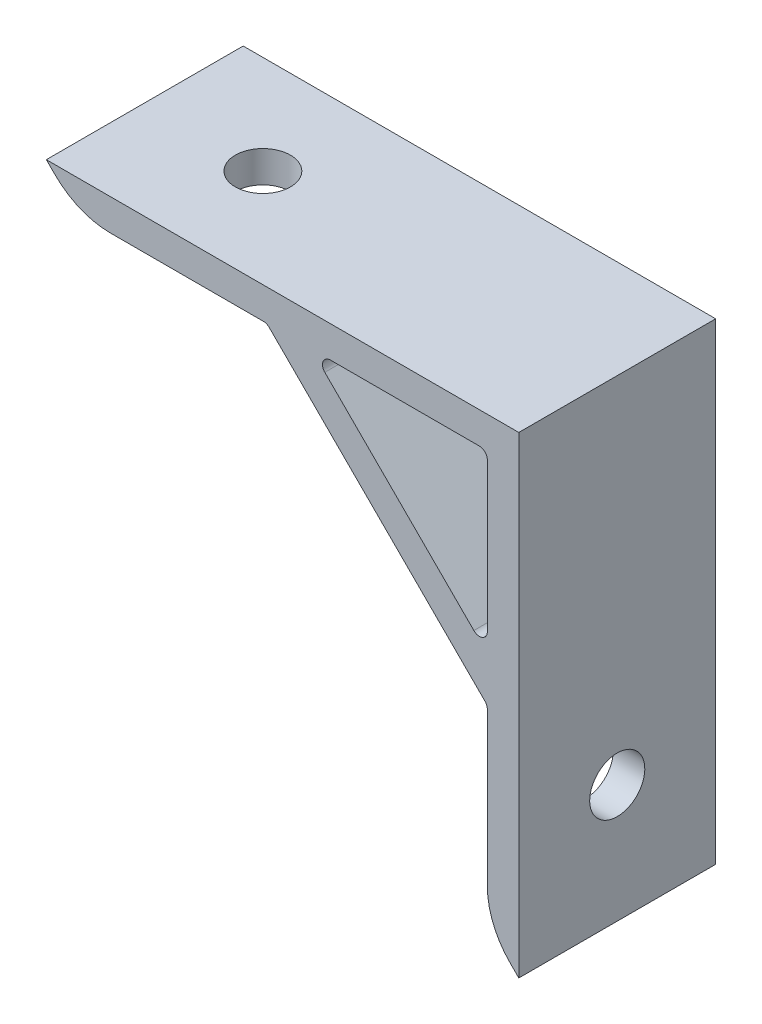
ISO-10303-21;
HEADER;
FILE_DESCRIPTION(('STEP AP214'),'2;1');
FILE_NAME('part.step','',(''),(''),'','','');
FILE_SCHEMA(('AUTOMOTIVE_DESIGN { 1 0 10303 214 1 1 1 1 }'));
ENDSEC;
DATA;
#1=APPLICATION_CONTEXT('core data for automotive mechanical design processes');
#2=APPLICATION_PROTOCOL_DEFINITION('international standard','automotive_design',2000,#1);
#3=PRODUCT_CONTEXT('',#1,'mechanical');
#4=PRODUCT('Part','Part','',(#3));
#5=PRODUCT_RELATED_PRODUCT_CATEGORY('part','',(#4));
#6=PRODUCT_DEFINITION_FORMATION('','',#4);
#7=PRODUCT_DEFINITION_CONTEXT('part definition',#1,'design');
#8=PRODUCT_DEFINITION('design','',#6,#7);
#9=PRODUCT_DEFINITION_SHAPE('','',#8);
#10=(LENGTH_UNIT() NAMED_UNIT(*) SI_UNIT(.MILLI.,.METRE.));
#11=(NAMED_UNIT(*) PLANE_ANGLE_UNIT() SI_UNIT($,.RADIAN.));
#12=(NAMED_UNIT(*) SI_UNIT($,.STERADIAN.) SOLID_ANGLE_UNIT());
#13=UNCERTAINTY_MEASURE_WITH_UNIT(LENGTH_MEASURE(1.E-05),#10,'distance_accuracy_value','');
#14=(GEOMETRIC_REPRESENTATION_CONTEXT(3) GLOBAL_UNCERTAINTY_ASSIGNED_CONTEXT((#13)) GLOBAL_UNIT_ASSIGNED_CONTEXT((#10,
#11,#12)) REPRESENTATION_CONTEXT('',''));
#15=CARTESIAN_POINT('',(0.,0.,0.));
#16=DIRECTION('',(0.,0.,1.));
#17=DIRECTION('',(1.,0.,0.));
#18=AXIS2_PLACEMENT_3D('',#15,#16,#17);
#19=CARTESIAN_POINT('',(0.,0.,25.));
#20=DIRECTION('',(0.,0.,1.));
#21=DIRECTION('',(1.,0.,0.));
#22=AXIS2_PLACEMENT_3D('',#19,#20,#21);
#23=PLANE('',#22);
#24=DIRECTION('',(0.707106781186548,-0.707106781186547,0.));
#25=VECTOR('',#24,1.);
#26=CARTESIAN_POINT('',(-2.,26.,25.));
#27=LINE('',#26,#25);
#28=CARTESIAN_POINT('',(-1.70710678118655,25.7071067811865,25.));
#29=VERTEX_POINT('',#28);
#30=CARTESIAN_POINT('',(25.7071067811866,-1.70710678118655,25.));
#31=VERTEX_POINT('',#30);
#32=EDGE_CURVE('E298',#29,#31,#27,.T.);
#33=ORIENTED_EDGE('',*,*,#32,.T.);
#34=CARTESIAN_POINT('',(25.,-2.41421356237309,25.));
#35=DIRECTION('',(0.,0.,1.));
#36=DIRECTION('',(1.,0.,0.));
#37=AXIS2_PLACEMENT_3D('',#34,#35,#36);
#38=CIRCLE('',#37,1.);
#39=CARTESIAN_POINT('',(26.,-2.41421356237309,25.));
#40=VERTEX_POINT('',#39);
#41=EDGE_CURVE('E256',#31,#40,#38,.F.);
#42=ORIENTED_EDGE('',*,*,#41,.T.);
#43=DIRECTION('',(0.,-1.,0.));
#44=VECTOR('',#43,1.);
#45=CARTESIAN_POINT('',(26.,-1.99999999999999,25.));
#46=LINE('',#45,#44);
#47=CARTESIAN_POINT('',(26.,-21.8578643762691,25.));
#48=VERTEX_POINT('',#47);
#49=EDGE_CURVE('E163',#40,#48,#46,.T.);
#50=ORIENTED_EDGE('',*,*,#49,.T.);
#51=CARTESIAN_POINT('',(36.,-21.8578643762691,25.));
#52=DIRECTION('',(0.,0.,1.));
#53=DIRECTION('',(1.,0.,0.));
#54=AXIS2_PLACEMENT_3D('',#51,#52,#53);
#55=CIRCLE('',#54,10.);
#56=CARTESIAN_POINT('',(28.9289321881345,-28.9289321881345,25.));
#57=VERTEX_POINT('',#56);
#58=EDGE_CURVE('E159',#48,#57,#55,.T.);
#59=ORIENTED_EDGE('',*,*,#58,.T.);
#60=DIRECTION('',(0.707106781186548,-0.707106781186547,0.));
#61=VECTOR('',#60,1.);
#62=CARTESIAN_POINT('',(30.,-30.,25.));
#63=LINE('',#62,#61);
#64=CARTESIAN_POINT('',(30.,-30.,25.));
#65=VERTEX_POINT('',#64);
#66=EDGE_CURVE('E152',#57,#65,#63,.T.);
#67=ORIENTED_EDGE('',*,*,#66,.T.);
#68=DIRECTION('',(0.,1.,0.));
#69=VECTOR('',#68,1.);
#70=CARTESIAN_POINT('',(30.,30.,25.));
#71=LINE('',#70,#69);
#72=CARTESIAN_POINT('',(30.,30.,25.));
#73=VERTEX_POINT('',#72);
#74=EDGE_CURVE('E156',#65,#73,#71,.T.);
#75=ORIENTED_EDGE('',*,*,#74,.T.);
#76=DIRECTION('',(-1.,0.,0.));
#77=VECTOR('',#76,1.);
#78=CARTESIAN_POINT('',(-30.,30.,25.));
#79=LINE('',#78,#77);
#80=CARTESIAN_POINT('',(-30.,30.,25.));
#81=VERTEX_POINT('',#80);
#82=EDGE_CURVE('E178',#73,#81,#79,.T.);
#83=ORIENTED_EDGE('',*,*,#82,.T.);
#84=DIRECTION('',(0.707106781186548,-0.707106781186548,0.));
#85=VECTOR('',#84,1.);
#86=CARTESIAN_POINT('',(-30.,30.,25.));
#87=LINE('',#86,#85);
#88=CARTESIAN_POINT('',(-28.9289321881345,28.9289321881345,25.));
#89=VERTEX_POINT('',#88);
#90=EDGE_CURVE('E201',#81,#89,#87,.T.);
#91=ORIENTED_EDGE('',*,*,#90,.T.);
#92=CARTESIAN_POINT('',(-21.8578643762691,36.,25.));
#93=DIRECTION('',(0.,0.,1.));
#94=DIRECTION('',(1.,0.,0.));
#95=AXIS2_PLACEMENT_3D('',#92,#93,#94);
#96=CIRCLE('',#95,10.);
#97=CARTESIAN_POINT('',(-21.8578643762691,26.,25.));
#98=VERTEX_POINT('',#97);
#99=EDGE_CURVE('E214',#89,#98,#96,.T.);
#100=ORIENTED_EDGE('',*,*,#99,.T.);
#101=DIRECTION('',(1.,0.,0.));
#102=VECTOR('',#101,1.);
#103=CARTESIAN_POINT('',(-26.,26.,25.));
#104=LINE('',#103,#102);
#105=CARTESIAN_POINT('',(-2.4142135623731,26.,25.));
#106=VERTEX_POINT('',#105);
#107=EDGE_CURVE('E295',#98,#106,#104,.T.);
#108=ORIENTED_EDGE('',*,*,#107,.T.);
#109=CARTESIAN_POINT('',(-2.4142135623731,25.,25.));
#110=DIRECTION('',(0.,0.,1.));
#111=DIRECTION('',(1.,0.,0.));
#112=AXIS2_PLACEMENT_3D('',#109,#110,#111);
#113=CIRCLE('',#112,1.);
#114=EDGE_CURVE('E252',#106,#29,#113,.F.);
#115=ORIENTED_EDGE('',*,*,#114,.T.);
#116=EDGE_LOOP('',(#33,#42,#50,#59,#67,#75,#83,#91,#100,#108,#115));
#117=FACE_BOUND('',#116,.T.);
#118=DIRECTION('',(0.707106781186548,-0.707106781186547,0.));
#119=VECTOR('',#118,1.);
#120=CARTESIAN_POINT('',(3.65685424949237,26.,25.));
#121=LINE('',#120,#119);
#122=CARTESIAN_POINT('',(5.36396103067892,24.2928932188135,25.));
#123=VERTEX_POINT('',#122);
#124=CARTESIAN_POINT('',(24.2928932188135,5.36396103067892,25.));
#125=VERTEX_POINT('',#124);
#126=EDGE_CURVE('E279',#123,#125,#121,.T.);
#127=ORIENTED_EDGE('',*,*,#126,.F.);
#128=CARTESIAN_POINT('',(6.07106781186546,25.,25.));
#129=DIRECTION('',(0.,0.,1.));
#130=DIRECTION('',(1.,0.,0.));
#131=AXIS2_PLACEMENT_3D('',#128,#129,#130);
#132=CIRCLE('',#131,1.);
#133=CARTESIAN_POINT('',(6.07106781186546,26.,25.));
#134=VERTEX_POINT('',#133);
#135=EDGE_CURVE('E11',#123,#134,#132,.F.);
#136=ORIENTED_EDGE('',*,*,#135,.T.);
#137=DIRECTION('',(-1.,0.,0.));
#138=VECTOR('',#137,1.);
#139=CARTESIAN_POINT('',(3.65685424949237,26.,25.));
#140=LINE('',#139,#138);
#141=CARTESIAN_POINT('',(25.,26.,25.));
#142=VERTEX_POINT('',#141);
#143=EDGE_CURVE('E277',#142,#134,#140,.T.);
#144=ORIENTED_EDGE('',*,*,#143,.F.);
#145=CARTESIAN_POINT('',(25.,25.,25.));
#146=DIRECTION('',(0.,0.,1.));
#147=DIRECTION('',(1.,0.,0.));
#148=AXIS2_PLACEMENT_3D('',#145,#146,#147);
#149=CIRCLE('',#148,1.);
#150=CARTESIAN_POINT('',(26.,25.,25.));
#151=VERTEX_POINT('',#150);
#152=EDGE_CURVE('E248',#142,#151,#149,.F.);
#153=ORIENTED_EDGE('',*,*,#152,.T.);
#154=DIRECTION('',(0.,1.,0.));
#155=VECTOR('',#154,1.);
#156=CARTESIAN_POINT('',(26.,26.,25.));
#157=LINE('',#156,#155);
#158=CARTESIAN_POINT('',(26.,6.07106781186547,25.));
#159=VERTEX_POINT('',#158);
#160=EDGE_CURVE('E188',#159,#151,#157,.T.);
#161=ORIENTED_EDGE('',*,*,#160,.F.);
#162=CARTESIAN_POINT('',(25.,6.07106781186547,25.));
#163=DIRECTION('',(0.,0.,1.));
#164=DIRECTION('',(1.,0.,0.));
#165=AXIS2_PLACEMENT_3D('',#162,#163,#164);
#166=CIRCLE('',#165,1.);
#167=EDGE_CURVE('E48',#159,#125,#166,.F.);
#168=ORIENTED_EDGE('',*,*,#167,.T.);
#169=EDGE_LOOP('',(#127,#136,#144,#153,#161,#168));
#170=FACE_BOUND('',#169,.T.);
#171=ADVANCED_FACE('F33',(#117,#170),#23,.T.);
#172=CARTESIAN_POINT('',(0.,0.,0.));
#173=DIRECTION('',(0.,0.,1.));
#174=DIRECTION('',(1.,0.,0.));
#175=AXIS2_PLACEMENT_3D('',#172,#173,#174);
#176=PLANE('',#175);
#177=DIRECTION('',(0.707106781186548,-0.707106781186547,0.));
#178=VECTOR('',#177,1.);
#179=CARTESIAN_POINT('',(30.,-30.,0.));
#180=LINE('',#179,#178);
#181=CARTESIAN_POINT('',(28.9289321881345,-28.9289321881345,0.));
#182=VERTEX_POINT('',#181);
#183=CARTESIAN_POINT('',(30.,-30.,0.));
#184=VERTEX_POINT('',#183);
#185=EDGE_CURVE('E169',#182,#184,#180,.T.);
#186=ORIENTED_EDGE('',*,*,#185,.F.);
#187=CARTESIAN_POINT('',(36.,-21.8578643762691,0.));
#188=DIRECTION('',(0.,0.,1.));
#189=DIRECTION('',(1.,0.,0.));
#190=AXIS2_PLACEMENT_3D('',#187,#188,#189);
#191=CIRCLE('',#190,10.);
#192=CARTESIAN_POINT('',(26.,-21.8578643762691,0.));
#193=VERTEX_POINT('',#192);
#194=EDGE_CURVE('E208',#182,#193,#191,.F.);
#195=ORIENTED_EDGE('',*,*,#194,.T.);
#196=DIRECTION('',(0.,-1.,0.));
#197=VECTOR('',#196,1.);
#198=CARTESIAN_POINT('',(26.,-1.99999999999999,0.));
#199=LINE('',#198,#197);
#200=CARTESIAN_POINT('',(26.,-2.41421356237309,0.));
#201=VERTEX_POINT('',#200);
#202=EDGE_CURVE('E194',#201,#193,#199,.T.);
#203=ORIENTED_EDGE('',*,*,#202,.F.);
#204=CARTESIAN_POINT('',(25.,-2.41421356237309,0.));
#205=DIRECTION('',(0.,0.,1.));
#206=DIRECTION('',(1.,0.,0.));
#207=AXIS2_PLACEMENT_3D('',#204,#205,#206);
#208=CIRCLE('',#207,1.);
#209=CARTESIAN_POINT('',(25.7071067811866,-1.70710678118655,0.));
#210=VERTEX_POINT('',#209);
#211=EDGE_CURVE('E254',#201,#210,#208,.T.);
#212=ORIENTED_EDGE('',*,*,#211,.T.);
#213=DIRECTION('',(0.707106781186548,-0.707106781186547,0.));
#214=VECTOR('',#213,1.);
#215=CARTESIAN_POINT('',(-2.,26.,0.));
#216=LINE('',#215,#214);
#217=CARTESIAN_POINT('',(-1.70710678118655,25.7071067811865,0.));
#218=VERTEX_POINT('',#217);
#219=EDGE_CURVE('E191',#218,#210,#216,.T.);
#220=ORIENTED_EDGE('',*,*,#219,.F.);
#221=CARTESIAN_POINT('',(-2.4142135623731,25.,0.));
#222=DIRECTION('',(0.,0.,1.));
#223=DIRECTION('',(1.,0.,0.));
#224=AXIS2_PLACEMENT_3D('',#221,#222,#223);
#225=CIRCLE('',#224,1.);
#226=CARTESIAN_POINT('',(-2.4142135623731,26.,0.));
#227=VERTEX_POINT('',#226);
#228=EDGE_CURVE('E250',#218,#227,#225,.T.);
#229=ORIENTED_EDGE('',*,*,#228,.T.);
#230=DIRECTION('',(1.,0.,0.));
#231=VECTOR('',#230,1.);
#232=CARTESIAN_POINT('',(-26.,26.,0.));
#233=LINE('',#232,#231);
#234=CARTESIAN_POINT('',(-21.8578643762691,26.,0.));
#235=VERTEX_POINT('',#234);
#236=EDGE_CURVE('E187',#235,#227,#233,.T.);
#237=ORIENTED_EDGE('',*,*,#236,.F.);
#238=CARTESIAN_POINT('',(-21.8578643762691,36.,0.));
#239=DIRECTION('',(0.,0.,1.));
#240=DIRECTION('',(1.,0.,0.));
#241=AXIS2_PLACEMENT_3D('',#238,#239,#240);
#242=CIRCLE('',#241,10.);
#243=CARTESIAN_POINT('',(-28.9289321881345,28.9289321881345,0.));
#244=VERTEX_POINT('',#243);
#245=EDGE_CURVE('E206',#235,#244,#242,.F.);
#246=ORIENTED_EDGE('',*,*,#245,.T.);
#247=DIRECTION('',(0.707106781186548,-0.707106781186548,0.));
#248=VECTOR('',#247,1.);
#249=CARTESIAN_POINT('',(-30.,30.,0.));
#250=LINE('',#249,#248);
#251=CARTESIAN_POINT('',(-30.,30.,0.));
#252=VERTEX_POINT('',#251);
#253=EDGE_CURVE('E184',#252,#244,#250,.T.);
#254=ORIENTED_EDGE('',*,*,#253,.F.);
#255=DIRECTION('',(-1.,0.,0.));
#256=VECTOR('',#255,1.);
#257=CARTESIAN_POINT('',(-30.,30.,0.));
#258=LINE('',#257,#256);
#259=CARTESIAN_POINT('',(30.,30.,0.));
#260=VERTEX_POINT('',#259);
#261=EDGE_CURVE('E199',#260,#252,#258,.T.);
#262=ORIENTED_EDGE('',*,*,#261,.F.);
#263=DIRECTION('',(0.,1.,0.));
#264=VECTOR('',#263,1.);
#265=CARTESIAN_POINT('',(30.,30.,0.));
#266=LINE('',#265,#264);
#267=EDGE_CURVE('E197',#184,#260,#266,.T.);
#268=ORIENTED_EDGE('',*,*,#267,.F.);
#269=EDGE_LOOP('',(#186,#195,#203,#212,#220,#229,#237,#246,#254,#262,#268));
#270=FACE_BOUND('',#269,.T.);
#271=DIRECTION('',(0.,1.,0.));
#272=VECTOR('',#271,1.);
#273=CARTESIAN_POINT('',(26.,26.,0.));
#274=LINE('',#273,#272);
#275=CARTESIAN_POINT('',(26.,6.07106781186547,0.));
#276=VERTEX_POINT('',#275);
#277=CARTESIAN_POINT('',(26.,25.,0.));
#278=VERTEX_POINT('',#277);
#279=EDGE_CURVE('E272',#276,#278,#274,.T.);
#280=ORIENTED_EDGE('',*,*,#279,.T.);
#281=CARTESIAN_POINT('',(25.,25.,0.));
#282=DIRECTION('',(0.,0.,1.));
#283=DIRECTION('',(1.,0.,0.));
#284=AXIS2_PLACEMENT_3D('',#281,#282,#283);
#285=CIRCLE('',#284,1.);
#286=CARTESIAN_POINT('',(25.,26.,0.));
#287=VERTEX_POINT('',#286);
#288=EDGE_CURVE('E246',#278,#287,#285,.T.);
#289=ORIENTED_EDGE('',*,*,#288,.T.);
#290=DIRECTION('',(-1.,0.,0.));
#291=VECTOR('',#290,1.);
#292=CARTESIAN_POINT('',(3.65685424949237,26.,0.));
#293=LINE('',#292,#291);
#294=CARTESIAN_POINT('',(6.07106781186546,26.,0.));
#295=VERTEX_POINT('',#294);
#296=EDGE_CURVE('E267',#287,#295,#293,.T.);
#297=ORIENTED_EDGE('',*,*,#296,.T.);
#298=CARTESIAN_POINT('',(6.07106781186546,25.,0.));
#299=DIRECTION('',(0.,0.,1.));
#300=DIRECTION('',(1.,0.,0.));
#301=AXIS2_PLACEMENT_3D('',#298,#299,#300);
#302=CIRCLE('',#301,1.);
#303=CARTESIAN_POINT('',(5.36396103067892,24.2928932188135,0.));
#304=VERTEX_POINT('',#303);
#305=EDGE_CURVE('E41',#295,#304,#302,.T.);
#306=ORIENTED_EDGE('',*,*,#305,.T.);
#307=DIRECTION('',(0.707106781186548,-0.707106781186547,0.));
#308=VECTOR('',#307,1.);
#309=CARTESIAN_POINT('',(3.65685424949237,26.,0.));
#310=LINE('',#309,#308);
#311=CARTESIAN_POINT('',(24.2928932188135,5.36396103067892,0.));
#312=VERTEX_POINT('',#311);
#313=EDGE_CURVE('E265',#304,#312,#310,.T.);
#314=ORIENTED_EDGE('',*,*,#313,.T.);
#315=CARTESIAN_POINT('',(25.,6.07106781186547,0.));
#316=DIRECTION('',(0.,0.,1.));
#317=DIRECTION('',(1.,0.,0.));
#318=AXIS2_PLACEMENT_3D('',#315,#316,#317);
#319=CIRCLE('',#318,1.);
#320=EDGE_CURVE('E258',#312,#276,#319,.T.);
#321=ORIENTED_EDGE('',*,*,#320,.T.);
#322=EDGE_LOOP('',(#280,#289,#297,#306,#314,#321));
#323=FACE_BOUND('',#322,.T.);
#324=ADVANCED_FACE('F264',(#270,#323),#176,.F.);
#325=CARTESIAN_POINT('',(-30.,30.,25.));
#326=DIRECTION('',(0.707106781186548,0.707106781186548,0.));
#327=DIRECTION('',(-0.707106781186548,0.707106781186548,0.));
#328=AXIS2_PLACEMENT_3D('',#325,#326,#327);
#329=PLANE('',#328);
#330=ORIENTED_EDGE('',*,*,#253,.T.);
#331=DIRECTION('',(0.,0.,-1.));
#332=VECTOR('',#331,1.);
#333=CARTESIAN_POINT('',(-28.9289321881345,28.9289321881345,25.));
#334=LINE('',#333,#332);
#335=EDGE_CURVE('E220',#244,#89,#334,.F.);
#336=ORIENTED_EDGE('',*,*,#335,.T.);
#337=ORIENTED_EDGE('',*,*,#90,.F.);
#338=DIRECTION('',(0.,0.,-1.));
#339=VECTOR('',#338,1.);
#340=CARTESIAN_POINT('',(-30.,30.,25.));
#341=LINE('',#340,#339);
#342=EDGE_CURVE('E180',#81,#252,#341,.T.);
#343=ORIENTED_EDGE('',*,*,#342,.T.);
#344=EDGE_LOOP('',(#330,#336,#337,#343));
#345=FACE_BOUND('',#344,.T.);
#346=ADVANCED_FACE('F352',(#345),#329,.F.);
#347=CARTESIAN_POINT('',(-26.,26.,25.));
#348=DIRECTION('',(0.,1.,0.));
#349=DIRECTION('',(0.,0.,1.));
#350=AXIS2_PLACEMENT_3D('',#347,#348,#349);
#351=PLANE('',#350);
#352=CARTESIAN_POINT('',(-15.,26.,12.5));
#353=DIRECTION('',(0.,1.,0.));
#354=DIRECTION('',(0.,0.,1.));
#355=AXIS2_PLACEMENT_3D('',#352,#353,#354);
#356=CIRCLE('',#355,3.5);
#357=CARTESIAN_POINT('',(-15.,26.,16.));
#358=VERTEX_POINT('',#357);
#359=EDGE_CURVE('E287',#358,#358,#356,.T.);
#360=ORIENTED_EDGE('',*,*,#359,.T.);
#361=EDGE_LOOP('',(#360));
#362=FACE_BOUND('',#361,.T.);
#363=ORIENTED_EDGE('',*,*,#236,.T.);
#364=DIRECTION('',(0.,0.,-1.));
#365=VECTOR('',#364,1.);
#366=CARTESIAN_POINT('',(-2.4142135623731,26.,25.));
#367=LINE('',#366,#365);
#368=EDGE_CURVE('E237',#227,#106,#367,.F.);
#369=ORIENTED_EDGE('',*,*,#368,.T.);
#370=ORIENTED_EDGE('',*,*,#107,.F.);
#371=DIRECTION('',(0.,0.,-1.));
#372=VECTOR('',#371,1.);
#373=CARTESIAN_POINT('',(-21.8578643762691,26.,25.));
#374=LINE('',#373,#372);
#375=EDGE_CURVE('E217',#98,#235,#374,.T.);
#376=ORIENTED_EDGE('',*,*,#375,.T.);
#377=EDGE_LOOP('',(#363,#369,#370,#376));
#378=FACE_BOUND('',#377,.T.);
#379=ADVANCED_FACE('F324',(#362,#378),#351,.F.);
#380=CARTESIAN_POINT('',(-2.,26.,25.));
#381=DIRECTION('',(0.707106781186547,0.707106781186548,0.));
#382=DIRECTION('',(-0.707106781186548,0.707106781186547,0.));
#383=AXIS2_PLACEMENT_3D('',#380,#381,#382);
#384=PLANE('',#383);
#385=ORIENTED_EDGE('',*,*,#32,.F.);
#386=DIRECTION('',(0.,0.,-1.));
#387=VECTOR('',#386,1.);
#388=CARTESIAN_POINT('',(-1.70710678118655,25.7071067811865,0.));
#389=LINE('',#388,#387);
#390=EDGE_CURVE('E234',#29,#218,#389,.T.);
#391=ORIENTED_EDGE('',*,*,#390,.T.);
#392=ORIENTED_EDGE('',*,*,#219,.T.);
#393=DIRECTION('',(0.,0.,-1.));
#394=VECTOR('',#393,1.);
#395=CARTESIAN_POINT('',(25.7071067811865,-1.70710678118655,25.));
#396=LINE('',#395,#394);
#397=EDGE_CURVE('E232',#210,#31,#396,.F.);
#398=ORIENTED_EDGE('',*,*,#397,.T.);
#399=EDGE_LOOP('',(#385,#391,#392,#398));
#400=FACE_BOUND('',#399,.T.);
#401=ADVANCED_FACE('F333',(#400),#384,.F.);
#402=CARTESIAN_POINT('',(26.,-1.99999999999999,25.));
#403=DIRECTION('',(1.,0.,0.));
#404=DIRECTION('',(0.,0.,-1.));
#405=AXIS2_PLACEMENT_3D('',#402,#403,#404);
#406=PLANE('',#405);
#407=CARTESIAN_POINT('',(26.,-15.,12.5));
#408=DIRECTION('',(1.,0.,0.));
#409=DIRECTION('',(0.,0.,-1.));
#410=AXIS2_PLACEMENT_3D('',#407,#408,#409);
#411=CIRCLE('',#410,3.5);
#412=CARTESIAN_POINT('',(26.,-15.,9.));
#413=VERTEX_POINT('',#412);
#414=EDGE_CURVE('E409',#413,#413,#411,.T.);
#415=ORIENTED_EDGE('',*,*,#414,.T.);
#416=EDGE_LOOP('',(#415));
#417=FACE_BOUND('',#416,.T.);
#418=ORIENTED_EDGE('',*,*,#49,.F.);
#419=DIRECTION('',(0.,0.,-1.));
#420=VECTOR('',#419,1.);
#421=CARTESIAN_POINT('',(26.,-2.41421356237309,0.));
#422=LINE('',#421,#420);
#423=EDGE_CURVE('E239',#40,#201,#422,.T.);
#424=ORIENTED_EDGE('',*,*,#423,.T.);
#425=ORIENTED_EDGE('',*,*,#202,.T.);
#426=DIRECTION('',(0.,0.,-1.));
#427=VECTOR('',#426,1.);
#428=CARTESIAN_POINT('',(26.,-21.8578643762691,25.));
#429=LINE('',#428,#427);
#430=EDGE_CURVE('E211',#193,#48,#429,.F.);
#431=ORIENTED_EDGE('',*,*,#430,.T.);
#432=EDGE_LOOP('',(#418,#424,#425,#431));
#433=FACE_BOUND('',#432,.T.);
#434=ADVANCED_FACE('F304',(#417,#433),#406,.F.);
#435=CARTESIAN_POINT('',(30.,-30.,25.));
#436=DIRECTION('',(0.707106781186547,0.707106781186548,0.));
#437=DIRECTION('',(-0.707106781186548,0.707106781186547,0.));
#438=AXIS2_PLACEMENT_3D('',#435,#436,#437);
#439=PLANE('',#438);
#440=ORIENTED_EDGE('',*,*,#66,.F.);
#441=DIRECTION('',(0.,0.,-1.));
#442=VECTOR('',#441,1.);
#443=CARTESIAN_POINT('',(28.9289321881345,-28.9289321881345,25.));
#444=LINE('',#443,#442);
#445=EDGE_CURVE('E172',#57,#182,#444,.T.);
#446=ORIENTED_EDGE('',*,*,#445,.T.);
#447=ORIENTED_EDGE('',*,*,#185,.T.);
#448=DIRECTION('',(0.,0.,-1.));
#449=VECTOR('',#448,1.);
#450=CARTESIAN_POINT('',(30.,-30.,25.));
#451=LINE('',#450,#449);
#452=EDGE_CURVE('E166',#65,#184,#451,.T.);
#453=ORIENTED_EDGE('',*,*,#452,.F.);
#454=EDGE_LOOP('',(#440,#446,#447,#453));
#455=FACE_BOUND('',#454,.T.);
#456=ADVANCED_FACE('F167',(#455),#439,.F.);
#457=CARTESIAN_POINT('',(30.,30.,25.));
#458=DIRECTION('',(-1.,0.,0.));
#459=DIRECTION('',(0.,-1.,0.));
#460=AXIS2_PLACEMENT_3D('',#457,#458,#459);
#461=PLANE('',#460);
#462=CARTESIAN_POINT('',(30.,-15.,12.5));
#463=DIRECTION('',(1.,0.,0.));
#464=DIRECTION('',(0.,1.,0.));
#465=AXIS2_PLACEMENT_3D('',#462,#463,#464);
#466=CIRCLE('',#465,3.5);
#467=CARTESIAN_POINT('',(30.,-11.5,12.5));
#468=VERTEX_POINT('',#467);
#469=EDGE_CURVE('E406',#468,#468,#466,.T.);
#470=ORIENTED_EDGE('',*,*,#469,.F.);
#471=EDGE_LOOP('',(#470));
#472=FACE_BOUND('',#471,.T.);
#473=ORIENTED_EDGE('',*,*,#267,.T.);
#474=DIRECTION('',(0.,0.,-1.));
#475=VECTOR('',#474,1.);
#476=CARTESIAN_POINT('',(30.,30.,25.));
#477=LINE('',#476,#475);
#478=EDGE_CURVE('E173',#73,#260,#477,.T.);
#479=ORIENTED_EDGE('',*,*,#478,.F.);
#480=ORIENTED_EDGE('',*,*,#74,.F.);
#481=ORIENTED_EDGE('',*,*,#452,.T.);
#482=EDGE_LOOP('',(#473,#479,#480,#481));
#483=FACE_BOUND('',#482,.T.);
#484=ADVANCED_FACE('F175',(#472,#483),#461,.F.);
#485=CARTESIAN_POINT('',(-30.,30.,25.));
#486=DIRECTION('',(0.,-1.,0.));
#487=DIRECTION('',(0.,0.,-1.));
#488=AXIS2_PLACEMENT_3D('',#485,#486,#487);
#489=PLANE('',#488);
#490=CARTESIAN_POINT('',(-15.,30.,12.5));
#491=DIRECTION('',(0.,1.,0.));
#492=DIRECTION('',(0.,0.,1.));
#493=AXIS2_PLACEMENT_3D('',#490,#491,#492);
#494=CIRCLE('',#493,3.5);
#495=CARTESIAN_POINT('',(-15.,30.,16.));
#496=VERTEX_POINT('',#495);
#497=EDGE_CURVE('E410',#496,#496,#494,.T.);
#498=ORIENTED_EDGE('',*,*,#497,.F.);
#499=EDGE_LOOP('',(#498));
#500=FACE_BOUND('',#499,.T.);
#501=ORIENTED_EDGE('',*,*,#261,.T.);
#502=ORIENTED_EDGE('',*,*,#342,.F.);
#503=ORIENTED_EDGE('',*,*,#82,.F.);
#504=ORIENTED_EDGE('',*,*,#478,.T.);
#505=EDGE_LOOP('',(#501,#502,#503,#504));
#506=FACE_BOUND('',#505,.T.);
#507=ADVANCED_FACE('F312',(#500,#506),#489,.F.);
#508=CARTESIAN_POINT('',(3.65685424949237,26.,25.));
#509=DIRECTION('',(0.,-1.,0.));
#510=DIRECTION('',(1.,0.,0.));
#511=AXIS2_PLACEMENT_3D('',#508,#509,#510);
#512=PLANE('',#511);
#513=ORIENTED_EDGE('',*,*,#296,.F.);
#514=DIRECTION('',(0.,0.,-1.));
#515=VECTOR('',#514,1.);
#516=CARTESIAN_POINT('',(25.,26.,25.));
#517=LINE('',#516,#515);
#518=EDGE_CURVE('E230',#287,#142,#517,.F.);
#519=ORIENTED_EDGE('',*,*,#518,.T.);
#520=ORIENTED_EDGE('',*,*,#143,.T.);
#521=DIRECTION('',(0.,0.,-1.));
#522=VECTOR('',#521,1.);
#523=CARTESIAN_POINT('',(6.07106781186546,26.,0.));
#524=LINE('',#523,#522);
#525=EDGE_CURVE('E227',#134,#295,#524,.T.);
#526=ORIENTED_EDGE('',*,*,#525,.T.);
#527=EDGE_LOOP('',(#513,#519,#520,#526));
#528=FACE_BOUND('',#527,.T.);
#529=ADVANCED_FACE('F281',(#528),#512,.T.);
#530=CARTESIAN_POINT('',(3.65685424949237,26.,25.));
#531=DIRECTION('',(0.707106781186547,0.707106781186548,0.));
#532=DIRECTION('',(-0.707106781186548,0.707106781186547,0.));
#533=AXIS2_PLACEMENT_3D('',#530,#531,#532);
#534=PLANE('',#533);
#535=ORIENTED_EDGE('',*,*,#126,.T.);
#536=DIRECTION('',(0.,0.,-1.));
#537=VECTOR('',#536,1.);
#538=CARTESIAN_POINT('',(24.2928932188135,5.36396103067892,0.));
#539=LINE('',#538,#537);
#540=EDGE_CURVE('E243',#125,#312,#539,.T.);
#541=ORIENTED_EDGE('',*,*,#540,.T.);
#542=ORIENTED_EDGE('',*,*,#313,.F.);
#543=DIRECTION('',(0.,0.,-1.));
#544=VECTOR('',#543,1.);
#545=CARTESIAN_POINT('',(5.36396103067892,24.2928932188135,25.));
#546=LINE('',#545,#544);
#547=EDGE_CURVE('E55',#304,#123,#546,.F.);
#548=ORIENTED_EDGE('',*,*,#547,.T.);
#549=EDGE_LOOP('',(#535,#541,#542,#548));
#550=FACE_BOUND('',#549,.T.);
#551=ADVANCED_FACE('F270',(#550),#534,.T.);
#552=CARTESIAN_POINT('',(26.,26.,25.));
#553=DIRECTION('',(-1.,0.,0.));
#554=DIRECTION('',(0.,-1.,0.));
#555=AXIS2_PLACEMENT_3D('',#552,#553,#554);
#556=PLANE('',#555);
#557=ORIENTED_EDGE('',*,*,#160,.T.);
#558=DIRECTION('',(0.,0.,-1.));
#559=VECTOR('',#558,1.);
#560=CARTESIAN_POINT('',(26.,25.,0.));
#561=LINE('',#560,#559);
#562=EDGE_CURVE('E224',#151,#278,#561,.T.);
#563=ORIENTED_EDGE('',*,*,#562,.T.);
#564=ORIENTED_EDGE('',*,*,#279,.F.);
#565=DIRECTION('',(0.,0.,-1.));
#566=VECTOR('',#565,1.);
#567=CARTESIAN_POINT('',(26.,6.07106781186547,25.));
#568=LINE('',#567,#566);
#569=EDGE_CURVE('E222',#276,#159,#568,.F.);
#570=ORIENTED_EDGE('',*,*,#569,.T.);
#571=EDGE_LOOP('',(#557,#563,#564,#570));
#572=FACE_BOUND('',#571,.T.);
#573=ADVANCED_FACE('F377',(#572),#556,.T.);
#574=CARTESIAN_POINT('',(36.,-21.8578643762691,25.));
#575=DIRECTION('',(0.,0.,-1.));
#576=DIRECTION('',(-1.,0.,0.));
#577=AXIS2_PLACEMENT_3D('',#574,#575,#576);
#578=CYLINDRICAL_SURFACE('',#577,10.);
#579=ORIENTED_EDGE('',*,*,#58,.F.);
#580=ORIENTED_EDGE('',*,*,#430,.F.);
#581=ORIENTED_EDGE('',*,*,#194,.F.);
#582=ORIENTED_EDGE('',*,*,#445,.F.);
#583=EDGE_LOOP('',(#579,#580,#581,#582));
#584=FACE_BOUND('',#583,.T.);
#585=ADVANCED_FACE('F307',(#584),#578,.T.);
#586=CARTESIAN_POINT('',(-21.8578643762691,36.,25.));
#587=DIRECTION('',(0.,0.,-1.));
#588=DIRECTION('',(-1.,0.,0.));
#589=AXIS2_PLACEMENT_3D('',#586,#587,#588);
#590=CYLINDRICAL_SURFACE('',#589,10.);
#591=ORIENTED_EDGE('',*,*,#99,.F.);
#592=ORIENTED_EDGE('',*,*,#335,.F.);
#593=ORIENTED_EDGE('',*,*,#245,.F.);
#594=ORIENTED_EDGE('',*,*,#375,.F.);
#595=EDGE_LOOP('',(#591,#592,#593,#594));
#596=FACE_BOUND('',#595,.T.);
#597=ADVANCED_FACE('F321',(#596),#590,.T.);
#598=CARTESIAN_POINT('',(25.,25.,25.));
#599=DIRECTION('',(0.,0.,1.));
#600=DIRECTION('',(1.,0.,0.));
#601=AXIS2_PLACEMENT_3D('',#598,#599,#600);
#602=CYLINDRICAL_SURFACE('',#601,1.);
#603=ORIENTED_EDGE('',*,*,#152,.F.);
#604=ORIENTED_EDGE('',*,*,#518,.F.);
#605=ORIENTED_EDGE('',*,*,#288,.F.);
#606=ORIENTED_EDGE('',*,*,#562,.F.);
#607=EDGE_LOOP('',(#603,#604,#605,#606));
#608=FACE_BOUND('',#607,.T.);
#609=ADVANCED_FACE('F345',(#608),#602,.F.);
#610=CARTESIAN_POINT('',(-2.4142135623731,25.,25.));
#611=DIRECTION('',(0.,0.,1.));
#612=DIRECTION('',(1.,0.,0.));
#613=AXIS2_PLACEMENT_3D('',#610,#611,#612);
#614=CYLINDRICAL_SURFACE('',#613,1.);
#615=ORIENTED_EDGE('',*,*,#114,.F.);
#616=ORIENTED_EDGE('',*,*,#368,.F.);
#617=ORIENTED_EDGE('',*,*,#228,.F.);
#618=ORIENTED_EDGE('',*,*,#390,.F.);
#619=EDGE_LOOP('',(#615,#616,#617,#618));
#620=FACE_BOUND('',#619,.T.);
#621=ADVANCED_FACE('F330',(#620),#614,.F.);
#622=CARTESIAN_POINT('',(25.,-2.41421356237309,25.));
#623=DIRECTION('',(0.,0.,1.));
#624=DIRECTION('',(1.,0.,0.));
#625=AXIS2_PLACEMENT_3D('',#622,#623,#624);
#626=CYLINDRICAL_SURFACE('',#625,1.);
#627=ORIENTED_EDGE('',*,*,#41,.F.);
#628=ORIENTED_EDGE('',*,*,#397,.F.);
#629=ORIENTED_EDGE('',*,*,#211,.F.);
#630=ORIENTED_EDGE('',*,*,#423,.F.);
#631=EDGE_LOOP('',(#627,#628,#629,#630));
#632=FACE_BOUND('',#631,.T.);
#633=ADVANCED_FACE('F336',(#632),#626,.F.);
#634=CARTESIAN_POINT('',(25.,6.07106781186547,25.));
#635=DIRECTION('',(0.,0.,1.));
#636=DIRECTION('',(1.,0.,0.));
#637=AXIS2_PLACEMENT_3D('',#634,#635,#636);
#638=CYLINDRICAL_SURFACE('',#637,1.);
#639=ORIENTED_EDGE('',*,*,#167,.F.);
#640=ORIENTED_EDGE('',*,*,#569,.F.);
#641=ORIENTED_EDGE('',*,*,#320,.F.);
#642=ORIENTED_EDGE('',*,*,#540,.F.);
#643=EDGE_LOOP('',(#639,#640,#641,#642));
#644=FACE_BOUND('',#643,.T.);
#645=ADVANCED_FACE('F338',(#644),#638,.F.);
#646=CARTESIAN_POINT('',(6.07106781186546,25.,25.));
#647=DIRECTION('',(0.,0.,1.));
#648=DIRECTION('',(1.,0.,0.));
#649=AXIS2_PLACEMENT_3D('',#646,#647,#648);
#650=CYLINDRICAL_SURFACE('',#649,1.);
#651=ORIENTED_EDGE('',*,*,#135,.F.);
#652=ORIENTED_EDGE('',*,*,#547,.F.);
#653=ORIENTED_EDGE('',*,*,#305,.F.);
#654=ORIENTED_EDGE('',*,*,#525,.F.);
#655=EDGE_LOOP('',(#651,#652,#653,#654));
#656=FACE_BOUND('',#655,.T.);
#657=ADVANCED_FACE('F35',(#656),#650,.F.);
#658=CARTESIAN_POINT('',(-15.,4.99999999999999,12.5));
#659=DIRECTION('',(0.,1.,0.));
#660=DIRECTION('',(0.,0.,1.));
#661=AXIS2_PLACEMENT_3D('',#658,#659,#660);
#662=CYLINDRICAL_SURFACE('',#661,3.5);
#663=ORIENTED_EDGE('',*,*,#497,.T.);
#664=EDGE_LOOP('',(#663));
#665=FACE_BOUND('',#664,.T.);
#666=ORIENTED_EDGE('',*,*,#359,.F.);
#667=EDGE_LOOP('',(#666));
#668=FACE_BOUND('',#667,.T.);
#669=ADVANCED_FACE('F394',(#665,#668),#662,.F.);
#670=CARTESIAN_POINT('',(5.,-15.,12.5));
#671=DIRECTION('',(1.,0.,0.));
#672=DIRECTION('',(0.,1.,0.));
#673=AXIS2_PLACEMENT_3D('',#670,#671,#672);
#674=CYLINDRICAL_SURFACE('',#673,3.5);
#675=ORIENTED_EDGE('',*,*,#469,.T.);
#676=EDGE_LOOP('',(#675));
#677=FACE_BOUND('',#676,.T.);
#678=ORIENTED_EDGE('',*,*,#414,.F.);
#679=EDGE_LOOP('',(#678));
#680=FACE_BOUND('',#679,.T.);
#681=ADVANCED_FACE('F397',(#677,#680),#674,.F.);
#682=CLOSED_SHELL('',(#171,#324,#346,#379,#401,#434,#456,#484,#507,#529,#551,#573,#585,#597,
#609,#621,#633,#645,#657,#669,#681));
#683=MANIFOLD_SOLID_BREP('B2',#682);
#684=ADVANCED_BREP_SHAPE_REPRESENTATION('',(#18,#683),#14);
#685=SHAPE_DEFINITION_REPRESENTATION(#9,#684);
ENDSEC;
END-ISO-10303-21;
